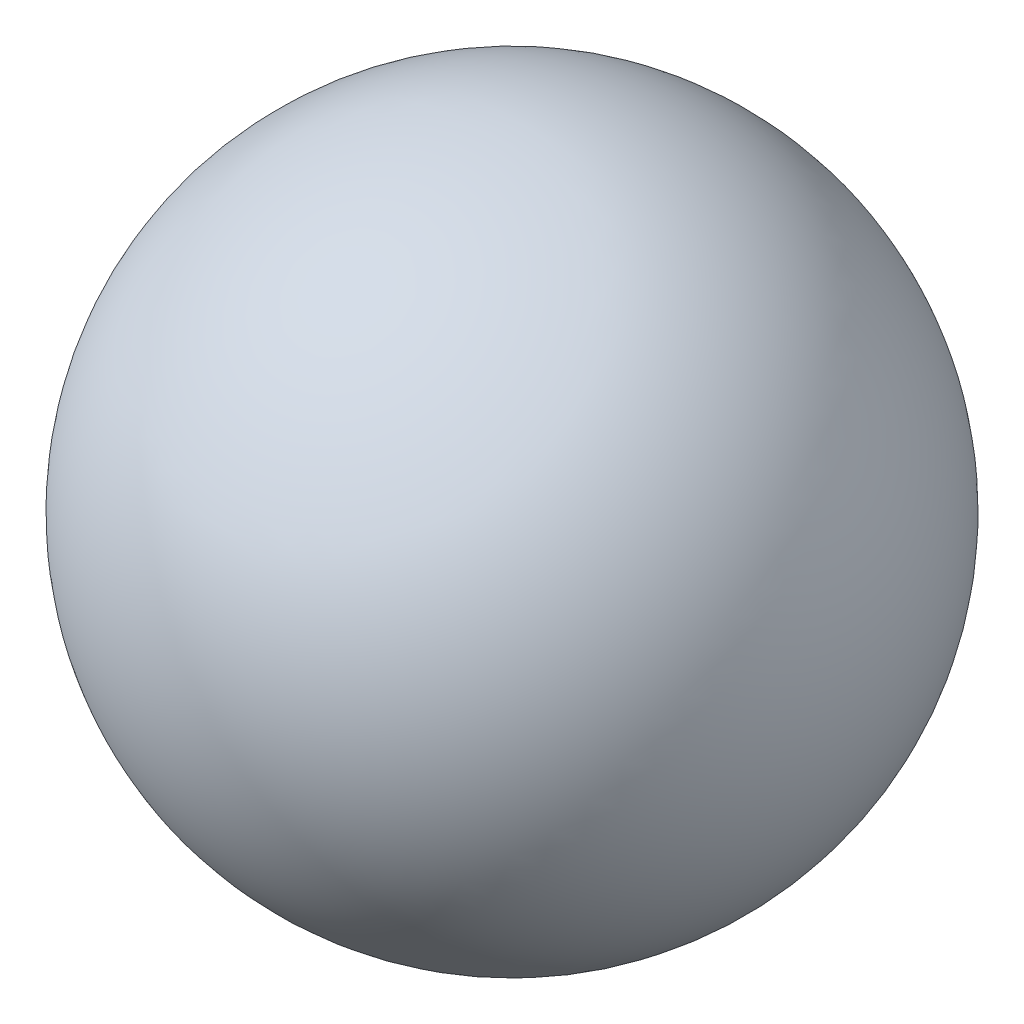
ISO-10303-21;
HEADER;
FILE_DESCRIPTION(('STEP AP214'),'2;1');
FILE_NAME('part.step','',(''),(''),'','','');
FILE_SCHEMA(('AUTOMOTIVE_DESIGN { 1 0 10303 214 1 1 1 1 }'));
ENDSEC;
DATA;
#1=APPLICATION_CONTEXT('core data for automotive mechanical design processes');
#2=APPLICATION_PROTOCOL_DEFINITION('international standard','automotive_design',2000,#1);
#3=PRODUCT_CONTEXT('',#1,'mechanical');
#4=PRODUCT('Part','Part','',(#3));
#5=PRODUCT_RELATED_PRODUCT_CATEGORY('part','',(#4));
#6=PRODUCT_DEFINITION_FORMATION('','',#4);
#7=PRODUCT_DEFINITION_CONTEXT('part definition',#1,'design');
#8=PRODUCT_DEFINITION('design','',#6,#7);
#9=PRODUCT_DEFINITION_SHAPE('','',#8);
#10=(LENGTH_UNIT() NAMED_UNIT(*) SI_UNIT(.MILLI.,.METRE.));
#11=(NAMED_UNIT(*) PLANE_ANGLE_UNIT() SI_UNIT($,.RADIAN.));
#12=(NAMED_UNIT(*) SI_UNIT($,.STERADIAN.) SOLID_ANGLE_UNIT());
#13=UNCERTAINTY_MEASURE_WITH_UNIT(LENGTH_MEASURE(1.E-05),#10,'distance_accuracy_value','');
#14=(GEOMETRIC_REPRESENTATION_CONTEXT(3) GLOBAL_UNCERTAINTY_ASSIGNED_CONTEXT((#13)) GLOBAL_UNIT_ASSIGNED_CONTEXT((#10,
#11,#12)) REPRESENTATION_CONTEXT('',''));
#15=CARTESIAN_POINT('',(0.,0.,0.));
#16=DIRECTION('',(0.,0.,1.));
#17=DIRECTION('',(1.,0.,0.));
#18=AXIS2_PLACEMENT_3D('',#15,#16,#17);
#19=CARTESIAN_POINT('',(-4.36703385400885,-2.,10.9083232129389));
#20=DIRECTION('',(0.,0.,1.));
#21=DIRECTION('',(1.,0.,0.));
#22=AXIS2_PLACEMENT_3D('',#19,#20,#21);
#23=SPHERICAL_SURFACE('',#22,1.05);
#24=CARTESIAN_POINT('',(-4.36703385400885,-2.,11.9583232129389));
#25=VERTEX_POINT('',#24);
#26=VERTEX_LOOP('',#25);
#27=FACE_BOUND('',#26,.T.);
#28=ADVANCED_FACE('F12',(#27),#23,.T.);
#29=CLOSED_SHELL('',(#28));
#30=MANIFOLD_SOLID_BREP('B1',#29);
#31=ADVANCED_BREP_SHAPE_REPRESENTATION('',(#18,#30),#14);
#32=SHAPE_DEFINITION_REPRESENTATION(#9,#31);
ENDSEC;
END-ISO-10303-21;
